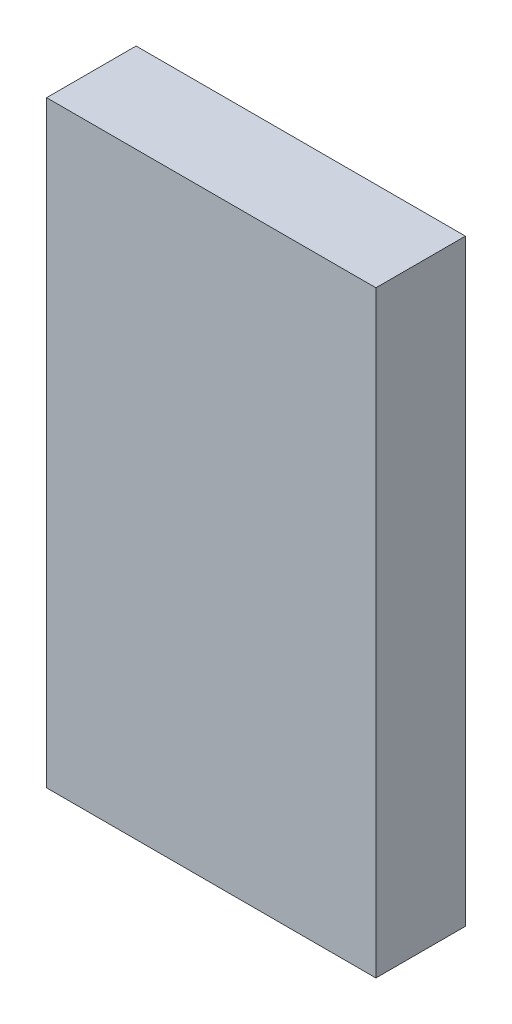
ISO-10303-21;
HEADER;
FILE_DESCRIPTION(('STEP AP214'),'2;1');
FILE_NAME('part.step','',(''),(''),'','','');
FILE_SCHEMA(('AUTOMOTIVE_DESIGN { 1 0 10303 214 1 1 1 1 }'));
ENDSEC;
DATA;
#1=APPLICATION_CONTEXT('core data for automotive mechanical design processes');
#2=APPLICATION_PROTOCOL_DEFINITION('international standard','automotive_design',2000,#1);
#3=PRODUCT_CONTEXT('',#1,'mechanical');
#4=PRODUCT('Part','Part','',(#3));
#5=PRODUCT_RELATED_PRODUCT_CATEGORY('part','',(#4));
#6=PRODUCT_DEFINITION_FORMATION('','',#4);
#7=PRODUCT_DEFINITION_CONTEXT('part definition',#1,'design');
#8=PRODUCT_DEFINITION('design','',#6,#7);
#9=PRODUCT_DEFINITION_SHAPE('','',#8);
#10=(LENGTH_UNIT() NAMED_UNIT(*) SI_UNIT(.MILLI.,.METRE.));
#11=(NAMED_UNIT(*) PLANE_ANGLE_UNIT() SI_UNIT($,.RADIAN.));
#12=(NAMED_UNIT(*) SI_UNIT($,.STERADIAN.) SOLID_ANGLE_UNIT());
#13=UNCERTAINTY_MEASURE_WITH_UNIT(LENGTH_MEASURE(1.E-05),#10,'distance_accuracy_value','');
#14=(GEOMETRIC_REPRESENTATION_CONTEXT(3) GLOBAL_UNCERTAINTY_ASSIGNED_CONTEXT((#13)) GLOBAL_UNIT_ASSIGNED_CONTEXT((#10,
#11,#12)) REPRESENTATION_CONTEXT('',''));
#15=CARTESIAN_POINT('',(0.,0.,0.));
#16=DIRECTION('',(0.,0.,1.));
#17=DIRECTION('',(1.,0.,0.));
#18=AXIS2_PLACEMENT_3D('',#15,#16,#17);
#19=CARTESIAN_POINT('',(-0.514,-1.439,0.));
#20=DIRECTION('',(1.,0.,0.));
#21=DIRECTION('',(0.,0.,1.));
#22=AXIS2_PLACEMENT_3D('',#19,#20,#21);
#23=PLANE('',#22);
#24=DIRECTION('',(0.,1.,0.));
#25=VECTOR('',#24,1.);
#26=CARTESIAN_POINT('',(-0.514,-1.439,0.1));
#27=LINE('',#26,#25);
#28=CARTESIAN_POINT('',(-0.514,-1.439,0.1));
#29=VERTEX_POINT('',#28);
#30=CARTESIAN_POINT('',(-0.514,-0.771,0.1));
#31=VERTEX_POINT('',#30);
#32=EDGE_CURVE('E11',#29,#31,#27,.T.);
#33=ORIENTED_EDGE('',*,*,#32,.T.);
#34=DIRECTION('',(0.,0.,1.));
#35=VECTOR('',#34,1.);
#36=CARTESIAN_POINT('',(-0.514,-0.771,0.));
#37=LINE('',#36,#35);
#38=CARTESIAN_POINT('',(-0.514,-0.771,0.));
#39=VERTEX_POINT('',#38);
#40=EDGE_CURVE('E24',#39,#31,#37,.T.);
#41=ORIENTED_EDGE('',*,*,#40,.F.);
#42=DIRECTION('',(0.,1.,0.));
#43=VECTOR('',#42,1.);
#44=CARTESIAN_POINT('',(-0.514,-1.439,0.));
#45=LINE('',#44,#43);
#46=CARTESIAN_POINT('',(-0.514,-1.439,0.));
#47=VERTEX_POINT('',#46);
#48=EDGE_CURVE('E86',#47,#39,#45,.T.);
#49=ORIENTED_EDGE('',*,*,#48,.F.);
#50=DIRECTION('',(0.,0.,1.));
#51=VECTOR('',#50,1.);
#52=CARTESIAN_POINT('',(-0.514,-1.439,0.));
#53=LINE('',#52,#51);
#54=EDGE_CURVE('E36',#47,#29,#53,.T.);
#55=ORIENTED_EDGE('',*,*,#54,.T.);
#56=EDGE_LOOP('',(#33,#41,#49,#55));
#57=FACE_BOUND('',#56,.T.);
#58=ADVANCED_FACE('F17',(#57),#23,.F.);
#59=CARTESIAN_POINT('',(-0.146,-1.439,0.));
#60=DIRECTION('',(1.,0.,0.));
#61=DIRECTION('',(0.,0.,1.));
#62=AXIS2_PLACEMENT_3D('',#59,#60,#61);
#63=PLANE('',#62);
#64=DIRECTION('',(0.,0.,1.));
#65=VECTOR('',#64,1.);
#66=CARTESIAN_POINT('',(-0.146,-1.439,0.));
#67=LINE('',#66,#65);
#68=CARTESIAN_POINT('',(-0.146,-1.439,0.));
#69=VERTEX_POINT('',#68);
#70=CARTESIAN_POINT('',(-0.146,-1.439,0.1));
#71=VERTEX_POINT('',#70);
#72=EDGE_CURVE('E83',#69,#71,#67,.T.);
#73=ORIENTED_EDGE('',*,*,#72,.F.);
#74=DIRECTION('',(0.,1.,0.));
#75=VECTOR('',#74,1.);
#76=CARTESIAN_POINT('',(-0.146,-1.439,0.));
#77=LINE('',#76,#75);
#78=CARTESIAN_POINT('',(-0.146,-0.771,0.));
#79=VERTEX_POINT('',#78);
#80=EDGE_CURVE('E63',#69,#79,#77,.T.);
#81=ORIENTED_EDGE('',*,*,#80,.T.);
#82=DIRECTION('',(0.,0.,1.));
#83=VECTOR('',#82,1.);
#84=CARTESIAN_POINT('',(-0.146,-0.771,0.));
#85=LINE('',#84,#83);
#86=CARTESIAN_POINT('',(-0.146,-0.771,0.1));
#87=VERTEX_POINT('',#86);
#88=EDGE_CURVE('E57',#79,#87,#85,.T.);
#89=ORIENTED_EDGE('',*,*,#88,.T.);
#90=DIRECTION('',(0.,1.,0.));
#91=VECTOR('',#90,1.);
#92=CARTESIAN_POINT('',(-0.146,-1.439,0.1));
#93=LINE('',#92,#91);
#94=EDGE_CURVE('E60',#71,#87,#93,.T.);
#95=ORIENTED_EDGE('',*,*,#94,.F.);
#96=EDGE_LOOP('',(#73,#81,#89,#95));
#97=FACE_BOUND('',#96,.T.);
#98=ADVANCED_FACE('F59',(#97),#63,.T.);
#99=CARTESIAN_POINT('',(-0.514,-1.439,0.));
#100=DIRECTION('',(0.,1.,0.));
#101=DIRECTION('',(0.,0.,1.));
#102=AXIS2_PLACEMENT_3D('',#99,#100,#101);
#103=PLANE('',#102);
#104=ORIENTED_EDGE('',*,*,#72,.T.);
#105=DIRECTION('',(1.,0.,0.));
#106=VECTOR('',#105,1.);
#107=CARTESIAN_POINT('',(-0.514,-1.439,0.1));
#108=LINE('',#107,#106);
#109=EDGE_CURVE('E71',#29,#71,#108,.T.);
#110=ORIENTED_EDGE('',*,*,#109,.F.);
#111=ORIENTED_EDGE('',*,*,#54,.F.);
#112=DIRECTION('',(1.,0.,0.));
#113=VECTOR('',#112,1.);
#114=CARTESIAN_POINT('',(-0.514,-1.439,0.));
#115=LINE('',#114,#113);
#116=EDGE_CURVE('E76',#47,#69,#115,.T.);
#117=ORIENTED_EDGE('',*,*,#116,.T.);
#118=EDGE_LOOP('',(#104,#110,#111,#117));
#119=FACE_BOUND('',#118,.T.);
#120=ADVANCED_FACE('F91',(#119),#103,.F.);
#121=CARTESIAN_POINT('',(-0.514,-0.771,0.));
#122=DIRECTION('',(0.,1.,0.));
#123=DIRECTION('',(0.,0.,1.));
#124=AXIS2_PLACEMENT_3D('',#121,#122,#123);
#125=PLANE('',#124);
#126=DIRECTION('',(1.,0.,0.));
#127=VECTOR('',#126,1.);
#128=CARTESIAN_POINT('',(-0.514,-0.771,0.));
#129=LINE('',#128,#127);
#130=EDGE_CURVE('E74',#39,#79,#129,.T.);
#131=ORIENTED_EDGE('',*,*,#130,.F.);
#132=ORIENTED_EDGE('',*,*,#40,.T.);
#133=DIRECTION('',(1.,0.,0.));
#134=VECTOR('',#133,1.);
#135=CARTESIAN_POINT('',(-0.514,-0.771,0.1));
#136=LINE('',#135,#134);
#137=EDGE_CURVE('E69',#31,#87,#136,.T.);
#138=ORIENTED_EDGE('',*,*,#137,.T.);
#139=ORIENTED_EDGE('',*,*,#88,.F.);
#140=EDGE_LOOP('',(#131,#132,#138,#139));
#141=FACE_BOUND('',#140,.T.);
#142=ADVANCED_FACE('F73',(#141),#125,.T.);
#143=CARTESIAN_POINT('',(-0.514,-1.439,0.));
#144=DIRECTION('',(0.,0.,1.));
#145=DIRECTION('',(1.,0.,0.));
#146=AXIS2_PLACEMENT_3D('',#143,#144,#145);
#147=PLANE('',#146);
#148=ORIENTED_EDGE('',*,*,#130,.T.);
#149=ORIENTED_EDGE('',*,*,#80,.F.);
#150=ORIENTED_EDGE('',*,*,#116,.F.);
#151=ORIENTED_EDGE('',*,*,#48,.T.);
#152=EDGE_LOOP('',(#148,#149,#150,#151));
#153=FACE_BOUND('',#152,.T.);
#154=ADVANCED_FACE('F89',(#153),#147,.F.);
#155=CARTESIAN_POINT('',(-0.514,-1.439,0.1));
#156=DIRECTION('',(0.,0.,1.));
#157=DIRECTION('',(1.,0.,0.));
#158=AXIS2_PLACEMENT_3D('',#155,#156,#157);
#159=PLANE('',#158);
#160=ORIENTED_EDGE('',*,*,#32,.F.);
#161=ORIENTED_EDGE('',*,*,#109,.T.);
#162=ORIENTED_EDGE('',*,*,#94,.T.);
#163=ORIENTED_EDGE('',*,*,#137,.F.);
#164=EDGE_LOOP('',(#160,#161,#162,#163));
#165=FACE_BOUND('',#164,.T.);
#166=ADVANCED_FACE('F68',(#165),#159,.T.);
#167=CLOSED_SHELL('',(#58,#98,#120,#142,#154,#166));
#168=MANIFOLD_SOLID_BREP('B1',#167);
#169=ADVANCED_BREP_SHAPE_REPRESENTATION('',(#18,#168),#14);
#170=SHAPE_DEFINITION_REPRESENTATION(#9,#169);
ENDSEC;
END-ISO-10303-21;
